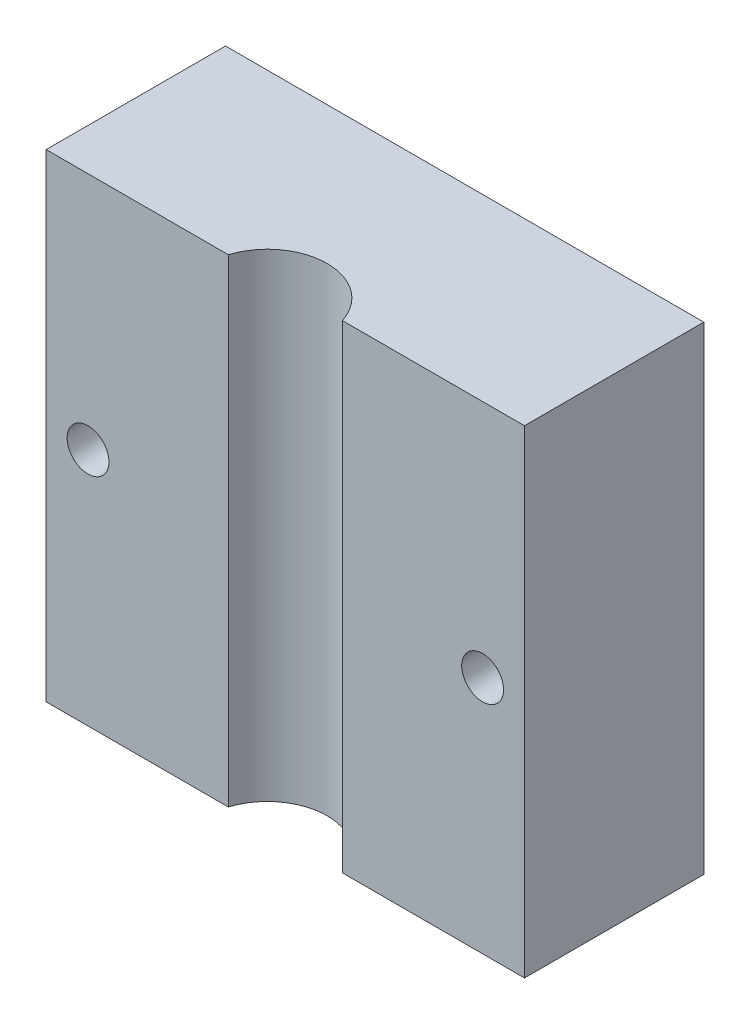
ISO-10303-21;
HEADER;
FILE_DESCRIPTION(('STEP AP214'),'2;1');
FILE_NAME('part.step','',(''),(''),'','','');
FILE_SCHEMA(('AUTOMOTIVE_DESIGN { 1 0 10303 214 1 1 1 1 }'));
ENDSEC;
DATA;
#1=APPLICATION_CONTEXT('core data for automotive mechanical design processes');
#2=APPLICATION_PROTOCOL_DEFINITION('international standard','automotive_design',2000,#1);
#3=PRODUCT_CONTEXT('',#1,'mechanical');
#4=PRODUCT('Part','Part','',(#3));
#5=PRODUCT_RELATED_PRODUCT_CATEGORY('part','',(#4));
#6=PRODUCT_DEFINITION_FORMATION('','',#4);
#7=PRODUCT_DEFINITION_CONTEXT('part definition',#1,'design');
#8=PRODUCT_DEFINITION('design','',#6,#7);
#9=PRODUCT_DEFINITION_SHAPE('','',#8);
#10=(LENGTH_UNIT() NAMED_UNIT(*) SI_UNIT(.MILLI.,.METRE.));
#11=(NAMED_UNIT(*) PLANE_ANGLE_UNIT() SI_UNIT($,.RADIAN.));
#12=(NAMED_UNIT(*) SI_UNIT($,.STERADIAN.) SOLID_ANGLE_UNIT());
#13=UNCERTAINTY_MEASURE_WITH_UNIT(LENGTH_MEASURE(1.E-05),#10,'distance_accuracy_value','');
#14=(GEOMETRIC_REPRESENTATION_CONTEXT(3) GLOBAL_UNCERTAINTY_ASSIGNED_CONTEXT((#13)) GLOBAL_UNIT_ASSIGNED_CONTEXT((#10,
#11,#12)) REPRESENTATION_CONTEXT('',''));
#15=CARTESIAN_POINT('',(0.,0.,0.));
#16=DIRECTION('',(0.,0.,1.));
#17=DIRECTION('',(1.,0.,0.));
#18=AXIS2_PLACEMENT_3D('',#15,#16,#17);
#19=CARTESIAN_POINT('',(0.,0.,15.));
#20=DIRECTION('',(0.,0.,1.));
#21=DIRECTION('',(1.,0.,0.));
#22=AXIS2_PLACEMENT_3D('',#19,#20,#21);
#23=PLANE('',#22);
#24=DIRECTION('',(0.,1.,0.));
#25=VECTOR('',#24,1.);
#26=CARTESIAN_POINT('',(4.76969600708473,-20.,15.));
#27=LINE('',#26,#25);
#28=CARTESIAN_POINT('',(4.76969600708473,-20.,15.));
#29=VERTEX_POINT('',#28);
#30=CARTESIAN_POINT('',(4.76969600708473,20.,15.));
#31=VERTEX_POINT('',#30);
#32=EDGE_CURVE('E11',#29,#31,#27,.T.);
#33=ORIENTED_EDGE('',*,*,#32,.F.);
#34=DIRECTION('',(1.,0.,0.));
#35=VECTOR('',#34,1.);
#36=CARTESIAN_POINT('',(-20.,-20.,15.));
#37=LINE('',#36,#35);
#38=CARTESIAN_POINT('',(20.,-20.,15.));
#39=VERTEX_POINT('',#38);
#40=EDGE_CURVE('E56',#29,#39,#37,.T.);
#41=ORIENTED_EDGE('',*,*,#40,.T.);
#42=DIRECTION('',(0.,1.,0.));
#43=VECTOR('',#42,1.);
#44=CARTESIAN_POINT('',(20.,20.,15.));
#45=LINE('',#44,#43);
#46=CARTESIAN_POINT('',(20.,20.,15.));
#47=VERTEX_POINT('',#46);
#48=EDGE_CURVE('E103',#39,#47,#45,.T.);
#49=ORIENTED_EDGE('',*,*,#48,.T.);
#50=DIRECTION('',(-1.,0.,0.));
#51=VECTOR('',#50,1.);
#52=CARTESIAN_POINT('',(-20.,20.,15.));
#53=LINE('',#52,#51);
#54=EDGE_CURVE('E85',#47,#31,#53,.T.);
#55=ORIENTED_EDGE('',*,*,#54,.T.);
#56=EDGE_LOOP('',(#33,#41,#49,#55));
#57=FACE_BOUND('',#56,.T.);
#58=CARTESIAN_POINT('',(16.5,0.,15.));
#59=DIRECTION('',(0.,0.,1.));
#60=DIRECTION('',(1.,0.,0.));
#61=AXIS2_PLACEMENT_3D('',#58,#59,#60);
#62=CIRCLE('',#61,1.75);
#63=CARTESIAN_POINT('',(18.25,0.,15.));
#64=VERTEX_POINT('',#63);
#65=EDGE_CURVE('E134',#64,#64,#62,.T.);
#66=ORIENTED_EDGE('',*,*,#65,.F.);
#67=EDGE_LOOP('',(#66));
#68=FACE_BOUND('',#67,.T.);
#69=ADVANCED_FACE('F33',(#57,#68),#23,.T.);
#70=CARTESIAN_POINT('',(20.,20.,15.));
#71=DIRECTION('',(-1.,0.,0.));
#72=DIRECTION('',(0.,0.,1.));
#73=AXIS2_PLACEMENT_3D('',#70,#71,#72);
#74=PLANE('',#73);
#75=DIRECTION('',(0.,1.,0.));
#76=VECTOR('',#75,1.);
#77=CARTESIAN_POINT('',(20.,20.,0.));
#78=LINE('',#77,#76);
#79=CARTESIAN_POINT('',(20.,-20.,0.));
#80=VERTEX_POINT('',#79);
#81=CARTESIAN_POINT('',(20.,20.,0.));
#82=VERTEX_POINT('',#81);
#83=EDGE_CURVE('E115',#80,#82,#78,.T.);
#84=ORIENTED_EDGE('',*,*,#83,.T.);
#85=DIRECTION('',(0.,0.,-1.));
#86=VECTOR('',#85,1.);
#87=CARTESIAN_POINT('',(20.,20.,15.));
#88=LINE('',#87,#86);
#89=EDGE_CURVE('E130',#47,#82,#88,.T.);
#90=ORIENTED_EDGE('',*,*,#89,.F.);
#91=ORIENTED_EDGE('',*,*,#48,.F.);
#92=DIRECTION('',(0.,0.,-1.));
#93=VECTOR('',#92,1.);
#94=CARTESIAN_POINT('',(20.,-20.,15.));
#95=LINE('',#94,#93);
#96=EDGE_CURVE('E114',#39,#80,#95,.T.);
#97=ORIENTED_EDGE('',*,*,#96,.T.);
#98=EDGE_LOOP('',(#84,#90,#91,#97));
#99=FACE_BOUND('',#98,.T.);
#100=ADVANCED_FACE('F35',(#99),#74,.F.);
#101=CARTESIAN_POINT('',(-20.,20.,15.));
#102=DIRECTION('',(0.,-1.,0.));
#103=DIRECTION('',(0.,0.,-1.));
#104=AXIS2_PLACEMENT_3D('',#101,#102,#103);
#105=PLANE('',#104);
#106=CARTESIAN_POINT('',(-4.76969600708473,20.,15.));
#107=VERTEX_POINT('',#106);
#108=CARTESIAN_POINT('',(-20.,20.,15.));
#109=VERTEX_POINT('',#108);
#110=EDGE_CURVE('E99',#107,#109,#53,.T.);
#111=ORIENTED_EDGE('',*,*,#110,.F.);
#112=CARTESIAN_POINT('',(0.,20.,16.5));
#113=DIRECTION('',(0.,1.,0.));
#114=DIRECTION('',(0.,0.,1.));
#115=AXIS2_PLACEMENT_3D('',#112,#113,#114);
#116=CIRCLE('',#115,5.);
#117=EDGE_CURVE('E47',#31,#107,#116,.T.);
#118=ORIENTED_EDGE('',*,*,#117,.F.);
#119=ORIENTED_EDGE('',*,*,#54,.F.);
#120=ORIENTED_EDGE('',*,*,#89,.T.);
#121=DIRECTION('',(-1.,0.,0.));
#122=VECTOR('',#121,1.);
#123=CARTESIAN_POINT('',(-20.,20.,0.));
#124=LINE('',#123,#122);
#125=CARTESIAN_POINT('',(-20.,20.,0.));
#126=VERTEX_POINT('',#125);
#127=EDGE_CURVE('E118',#82,#126,#124,.T.);
#128=ORIENTED_EDGE('',*,*,#127,.T.);
#129=DIRECTION('',(0.,0.,-1.));
#130=VECTOR('',#129,1.);
#131=CARTESIAN_POINT('',(-20.,20.,15.));
#132=LINE('',#131,#130);
#133=EDGE_CURVE('E127',#109,#126,#132,.T.);
#134=ORIENTED_EDGE('',*,*,#133,.F.);
#135=EDGE_LOOP('',(#111,#118,#119,#120,#128,#134));
#136=FACE_BOUND('',#135,.T.);
#137=ADVANCED_FACE('F97',(#136),#105,.F.);
#138=CARTESIAN_POINT('',(-20.,20.,15.));
#139=DIRECTION('',(1.,0.,0.));
#140=DIRECTION('',(0.,1.,0.));
#141=AXIS2_PLACEMENT_3D('',#138,#139,#140);
#142=PLANE('',#141);
#143=DIRECTION('',(0.,-1.,0.));
#144=VECTOR('',#143,1.);
#145=CARTESIAN_POINT('',(-20.,20.,0.));
#146=LINE('',#145,#144);
#147=CARTESIAN_POINT('',(-20.,-20.,0.));
#148=VERTEX_POINT('',#147);
#149=EDGE_CURVE('E121',#126,#148,#146,.T.);
#150=ORIENTED_EDGE('',*,*,#149,.T.);
#151=DIRECTION('',(0.,0.,-1.));
#152=VECTOR('',#151,1.);
#153=CARTESIAN_POINT('',(-20.,-20.,15.));
#154=LINE('',#153,#152);
#155=CARTESIAN_POINT('',(-20.,-20.,15.));
#156=VERTEX_POINT('',#155);
#157=EDGE_CURVE('E125',#156,#148,#154,.T.);
#158=ORIENTED_EDGE('',*,*,#157,.F.);
#159=DIRECTION('',(0.,-1.,0.));
#160=VECTOR('',#159,1.);
#161=CARTESIAN_POINT('',(-20.,20.,15.));
#162=LINE('',#161,#160);
#163=EDGE_CURVE('E105',#109,#156,#162,.T.);
#164=ORIENTED_EDGE('',*,*,#163,.F.);
#165=ORIENTED_EDGE('',*,*,#133,.T.);
#166=EDGE_LOOP('',(#150,#158,#164,#165));
#167=FACE_BOUND('',#166,.T.);
#168=ADVANCED_FACE('F141',(#167),#142,.F.);
#169=CARTESIAN_POINT('',(-20.,-20.,15.));
#170=DIRECTION('',(0.,1.,0.));
#171=DIRECTION('',(0.,0.,1.));
#172=AXIS2_PLACEMENT_3D('',#169,#170,#171);
#173=PLANE('',#172);
#174=ORIENTED_EDGE('',*,*,#40,.F.);
#175=CARTESIAN_POINT('',(0.,-20.,16.5));
#176=DIRECTION('',(0.,1.,0.));
#177=DIRECTION('',(0.,0.,1.));
#178=AXIS2_PLACEMENT_3D('',#175,#176,#177);
#179=CIRCLE('',#178,5.);
#180=CARTESIAN_POINT('',(-4.76969600708473,-20.,15.));
#181=VERTEX_POINT('',#180);
#182=EDGE_CURVE('E95',#29,#181,#179,.T.);
#183=ORIENTED_EDGE('',*,*,#182,.T.);
#184=EDGE_CURVE('E111',#156,#181,#37,.T.);
#185=ORIENTED_EDGE('',*,*,#184,.F.);
#186=ORIENTED_EDGE('',*,*,#157,.T.);
#187=DIRECTION('',(1.,0.,0.));
#188=VECTOR('',#187,1.);
#189=CARTESIAN_POINT('',(-20.,-20.,0.));
#190=LINE('',#189,#188);
#191=EDGE_CURVE('E78',#148,#80,#190,.T.);
#192=ORIENTED_EDGE('',*,*,#191,.T.);
#193=ORIENTED_EDGE('',*,*,#96,.F.);
#194=EDGE_LOOP('',(#174,#183,#185,#186,#192,#193));
#195=FACE_BOUND('',#194,.T.);
#196=ADVANCED_FACE('F133',(#195),#173,.F.);
#197=DIRECTION('',(0.,1.,0.));
#198=VECTOR('',#197,1.);
#199=CARTESIAN_POINT('',(-4.76969600708473,-20.,15.));
#200=LINE('',#199,#198);
#201=EDGE_CURVE('E41',#107,#181,#200,.F.);
#202=ORIENTED_EDGE('',*,*,#201,.F.);
#203=ORIENTED_EDGE('',*,*,#110,.T.);
#204=ORIENTED_EDGE('',*,*,#163,.T.);
#205=ORIENTED_EDGE('',*,*,#184,.T.);
#206=EDGE_LOOP('',(#202,#203,#204,#205));
#207=FACE_BOUND('',#206,.T.);
#208=CARTESIAN_POINT('',(-16.5,0.,15.));
#209=DIRECTION('',(0.,0.,1.));
#210=DIRECTION('',(1.,0.,0.));
#211=AXIS2_PLACEMENT_3D('',#208,#209,#210);
#212=CIRCLE('',#211,1.75);
#213=CARTESIAN_POINT('',(-14.75,0.,15.));
#214=VERTEX_POINT('',#213);
#215=EDGE_CURVE('E229',#214,#214,#212,.T.);
#216=ORIENTED_EDGE('',*,*,#215,.F.);
#217=EDGE_LOOP('',(#216));
#218=FACE_BOUND('',#217,.T.);
#219=ADVANCED_FACE('F136',(#207,#218),#23,.T.);
#220=CARTESIAN_POINT('',(0.,0.,0.));
#221=DIRECTION('',(0.,0.,1.));
#222=DIRECTION('',(1.,0.,0.));
#223=AXIS2_PLACEMENT_3D('',#220,#221,#222);
#224=PLANE('',#223);
#225=CARTESIAN_POINT('',(16.5,0.,0.));
#226=DIRECTION('',(0.,0.,1.));
#227=DIRECTION('',(1.,0.,0.));
#228=AXIS2_PLACEMENT_3D('',#225,#226,#227);
#229=CIRCLE('',#228,1.75);
#230=CARTESIAN_POINT('',(18.25,0.,0.));
#231=VERTEX_POINT('',#230);
#232=EDGE_CURVE('E230',#231,#231,#229,.T.);
#233=ORIENTED_EDGE('',*,*,#232,.T.);
#234=EDGE_LOOP('',(#233));
#235=FACE_BOUND('',#234,.T.);
#236=CARTESIAN_POINT('',(-16.5,0.,0.));
#237=DIRECTION('',(0.,0.,1.));
#238=DIRECTION('',(1.,0.,0.));
#239=AXIS2_PLACEMENT_3D('',#236,#237,#238);
#240=CIRCLE('',#239,1.75);
#241=CARTESIAN_POINT('',(-14.75,0.,0.));
#242=VERTEX_POINT('',#241);
#243=EDGE_CURVE('E119',#242,#242,#240,.T.);
#244=ORIENTED_EDGE('',*,*,#243,.T.);
#245=EDGE_LOOP('',(#244));
#246=FACE_BOUND('',#245,.T.);
#247=ORIENTED_EDGE('',*,*,#83,.F.);
#248=ORIENTED_EDGE('',*,*,#191,.F.);
#249=ORIENTED_EDGE('',*,*,#149,.F.);
#250=ORIENTED_EDGE('',*,*,#127,.F.);
#251=EDGE_LOOP('',(#247,#248,#249,#250));
#252=FACE_BOUND('',#251,.T.);
#253=ADVANCED_FACE('F145',(#235,#246,#252),#224,.F.);
#254=CARTESIAN_POINT('',(-16.5,0.,0.));
#255=DIRECTION('',(0.,0.,1.));
#256=DIRECTION('',(1.,0.,0.));
#257=AXIS2_PLACEMENT_3D('',#254,#255,#256);
#258=CYLINDRICAL_SURFACE('',#257,1.75);
#259=ORIENTED_EDGE('',*,*,#243,.F.);
#260=EDGE_LOOP('',(#259));
#261=FACE_BOUND('',#260,.T.);
#262=ORIENTED_EDGE('',*,*,#215,.T.);
#263=EDGE_LOOP('',(#262));
#264=FACE_BOUND('',#263,.T.);
#265=ADVANCED_FACE('F162',(#261,#264),#258,.F.);
#266=CARTESIAN_POINT('',(16.5,0.,0.));
#267=DIRECTION('',(0.,0.,1.));
#268=DIRECTION('',(1.,0.,0.));
#269=AXIS2_PLACEMENT_3D('',#266,#267,#268);
#270=CYLINDRICAL_SURFACE('',#269,1.75);
#271=ORIENTED_EDGE('',*,*,#232,.F.);
#272=EDGE_LOOP('',(#271));
#273=FACE_BOUND('',#272,.T.);
#274=ORIENTED_EDGE('',*,*,#65,.T.);
#275=EDGE_LOOP('',(#274));
#276=FACE_BOUND('',#275,.T.);
#277=ADVANCED_FACE('F197',(#273,#276),#270,.F.);
#278=CARTESIAN_POINT('',(0.,-20.,16.5));
#279=DIRECTION('',(0.,1.,0.));
#280=DIRECTION('',(0.,0.,1.));
#281=AXIS2_PLACEMENT_3D('',#278,#279,#280);
#282=CYLINDRICAL_SURFACE('',#281,5.);
#283=ORIENTED_EDGE('',*,*,#32,.T.);
#284=ORIENTED_EDGE('',*,*,#117,.T.);
#285=ORIENTED_EDGE('',*,*,#201,.T.);
#286=ORIENTED_EDGE('',*,*,#182,.F.);
#287=EDGE_LOOP('',(#283,#284,#285,#286));
#288=FACE_BOUND('',#287,.T.);
#289=ADVANCED_FACE('F93',(#288),#282,.F.);
#290=CLOSED_SHELL('',(#69,#100,#137,#168,#196,#219,#253,#265,#277,#289));
#291=MANIFOLD_SOLID_BREP('B2',#290);
#292=ADVANCED_BREP_SHAPE_REPRESENTATION('',(#18,#291),#14);
#293=SHAPE_DEFINITION_REPRESENTATION(#9,#292);
ENDSEC;
END-ISO-10303-21;
